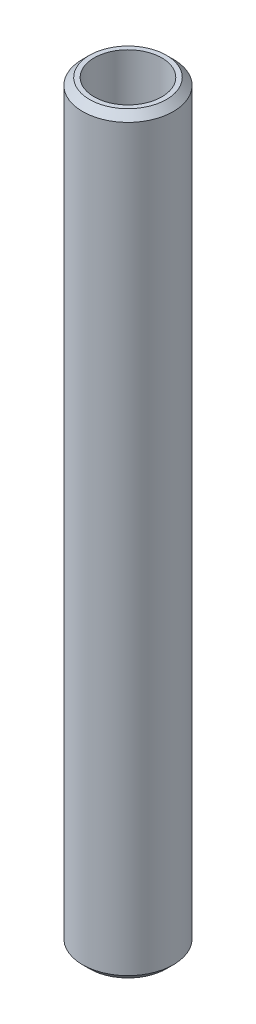
ISO-10303-21;
HEADER;
FILE_DESCRIPTION(('STEP AP214'),'2;1');
FILE_NAME('part.step','',(''),(''),'','','');
FILE_SCHEMA(('AUTOMOTIVE_DESIGN { 1 0 10303 214 1 1 1 1 }'));
ENDSEC;
DATA;
#1=APPLICATION_CONTEXT('core data for automotive mechanical design processes');
#2=APPLICATION_PROTOCOL_DEFINITION('international standard','automotive_design',2000,#1);
#3=PRODUCT_CONTEXT('',#1,'mechanical');
#4=PRODUCT('Part','Part','',(#3));
#5=PRODUCT_RELATED_PRODUCT_CATEGORY('part','',(#4));
#6=PRODUCT_DEFINITION_FORMATION('','',#4);
#7=PRODUCT_DEFINITION_CONTEXT('part definition',#1,'design');
#8=PRODUCT_DEFINITION('design','',#6,#7);
#9=PRODUCT_DEFINITION_SHAPE('','',#8);
#10=(LENGTH_UNIT() NAMED_UNIT(*) SI_UNIT(.MILLI.,.METRE.));
#11=(NAMED_UNIT(*) PLANE_ANGLE_UNIT() SI_UNIT($,.RADIAN.));
#12=(NAMED_UNIT(*) SI_UNIT($,.STERADIAN.) SOLID_ANGLE_UNIT());
#13=UNCERTAINTY_MEASURE_WITH_UNIT(LENGTH_MEASURE(1.E-05),#10,'distance_accuracy_value','');
#14=(GEOMETRIC_REPRESENTATION_CONTEXT(3) GLOBAL_UNCERTAINTY_ASSIGNED_CONTEXT((#13)) GLOBAL_UNIT_ASSIGNED_CONTEXT((#10,
#11,#12)) REPRESENTATION_CONTEXT('',''));
#15=CARTESIAN_POINT('',(0.,0.,0.));
#16=DIRECTION('',(0.,0.,1.));
#17=DIRECTION('',(1.,0.,0.));
#18=AXIS2_PLACEMENT_3D('',#15,#16,#17);
#19=CARTESIAN_POINT('',(0.,373.490931075071,0.));
#20=DIRECTION('',(0.,-1.,0.));
#21=DIRECTION('',(0.,0.,-1.));
#22=AXIS2_PLACEMENT_3D('',#19,#20,#21);
#23=CYLINDRICAL_SURFACE('',#22,22.5);
#24=CARTESIAN_POINT('',(0.,370.046088661592,0.));
#25=DIRECTION('',(0.,1.,0.));
#26=DIRECTION('',(0.,0.,1.));
#27=AXIS2_PLACEMENT_3D('',#24,#25,#26);
#28=CIRCLE('',#27,22.5);
#29=CARTESIAN_POINT('',(0.,370.046088661592,22.5));
#30=VERTEX_POINT('',#29);
#31=EDGE_CURVE('E50',#30,#30,#28,.F.);
#32=ORIENTED_EDGE('',*,*,#31,.T.);
#33=EDGE_LOOP('',(#32));
#34=FACE_BOUND('',#33,.T.);
#35=CARTESIAN_POINT('',(0.,3.44484241347864,0.));
#36=DIRECTION('',(0.,1.,0.));
#37=DIRECTION('',(0.,0.,1.));
#38=AXIS2_PLACEMENT_3D('',#35,#36,#37);
#39=CIRCLE('',#38,22.5);
#40=CARTESIAN_POINT('',(0.,3.44484241347864,22.5));
#41=VERTEX_POINT('',#40);
#42=EDGE_CURVE('E51',#41,#41,#39,.T.);
#43=ORIENTED_EDGE('',*,*,#42,.T.);
#44=EDGE_LOOP('',(#43));
#45=FACE_BOUND('',#44,.T.);
#46=ADVANCED_FACE('F39',(#34,#45),#23,.T.);
#47=CARTESIAN_POINT('',(0.,373.490931075071,0.));
#48=DIRECTION('',(0.,1.,0.));
#49=DIRECTION('',(0.,0.,1.));
#50=AXIS2_PLACEMENT_3D('',#47,#48,#49);
#51=PLANE('',#50);
#52=CARTESIAN_POINT('',(0.,373.490931075071,0.));
#53=DIRECTION('',(0.,1.,0.));
#54=DIRECTION('',(0.,0.,1.));
#55=AXIS2_PLACEMENT_3D('',#52,#53,#54);
#56=CIRCLE('',#55,19.0551575865213);
#57=CARTESIAN_POINT('',(0.,373.490931075071,19.0551575865213));
#58=VERTEX_POINT('',#57);
#59=EDGE_CURVE('E54',#58,#58,#56,.T.);
#60=ORIENTED_EDGE('',*,*,#59,.T.);
#61=EDGE_LOOP('',(#60));
#62=FACE_BOUND('',#61,.T.);
#63=CARTESIAN_POINT('',(0.,373.490931075071,0.));
#64=DIRECTION('',(0.,1.,0.));
#65=DIRECTION('',(0.,0.,1.));
#66=AXIS2_PLACEMENT_3D('',#63,#64,#65);
#67=CIRCLE('',#66,16.7843677541225);
#68=CARTESIAN_POINT('',(0.,373.490931075071,16.7843677541225));
#69=VERTEX_POINT('',#68);
#70=EDGE_CURVE('E58',#69,#69,#67,.T.);
#71=ORIENTED_EDGE('',*,*,#70,.F.);
#72=EDGE_LOOP('',(#71));
#73=FACE_BOUND('',#72,.T.);
#74=ADVANCED_FACE('F69',(#62,#73),#51,.T.);
#75=CARTESIAN_POINT('',(0.,0.,0.));
#76=DIRECTION('',(0.,1.,0.));
#77=DIRECTION('',(0.,0.,1.));
#78=AXIS2_PLACEMENT_3D('',#75,#76,#77);
#79=PLANE('',#78);
#80=CARTESIAN_POINT('',(0.,0.,0.));
#81=DIRECTION('',(0.,1.,0.));
#82=DIRECTION('',(0.,0.,1.));
#83=AXIS2_PLACEMENT_3D('',#80,#81,#82);
#84=CIRCLE('',#83,19.0551575865213);
#85=CARTESIAN_POINT('',(0.,0.,19.0551575865213));
#86=VERTEX_POINT('',#85);
#87=EDGE_CURVE('E10',#86,#86,#84,.F.);
#88=ORIENTED_EDGE('',*,*,#87,.T.);
#89=EDGE_LOOP('',(#88));
#90=FACE_BOUND('',#89,.T.);
#91=CARTESIAN_POINT('',(0.,0.,0.));
#92=DIRECTION('',(0.,1.,0.));
#93=DIRECTION('',(0.,0.,1.));
#94=AXIS2_PLACEMENT_3D('',#91,#92,#93);
#95=CIRCLE('',#94,16.7843677541225);
#96=CARTESIAN_POINT('',(0.,0.,16.7843677541225));
#97=VERTEX_POINT('',#96);
#98=EDGE_CURVE('E63',#97,#97,#95,.T.);
#99=ORIENTED_EDGE('',*,*,#98,.T.);
#100=EDGE_LOOP('',(#99));
#101=FACE_BOUND('',#100,.T.);
#102=ADVANCED_FACE('F75',(#90,#101),#79,.F.);
#103=CARTESIAN_POINT('',(0.,373.490931075071,0.));
#104=DIRECTION('',(0.,-1.,0.));
#105=DIRECTION('',(0.,0.,-1.));
#106=AXIS2_PLACEMENT_3D('',#103,#104,#105);
#107=CYLINDRICAL_SURFACE('',#106,16.7843677541225);
#108=ORIENTED_EDGE('',*,*,#70,.T.);
#109=EDGE_LOOP('',(#108));
#110=FACE_BOUND('',#109,.T.);
#111=ORIENTED_EDGE('',*,*,#98,.F.);
#112=EDGE_LOOP('',(#111));
#113=FACE_BOUND('',#112,.T.);
#114=ADVANCED_FACE('F70',(#110,#113),#107,.F.);
#115=CARTESIAN_POINT('',(0.,373.490931075071,0.));
#116=DIRECTION('',(0.,-1.,0.));
#117=DIRECTION('',(0.,0.,-1.));
#118=AXIS2_PLACEMENT_3D('',#115,#116,#117);
#119=CONICAL_SURFACE('',#118,19.0551575865213,0.785398163397446);
#120=ORIENTED_EDGE('',*,*,#31,.F.);
#121=EDGE_LOOP('',(#120));
#122=FACE_BOUND('',#121,.T.);
#123=ORIENTED_EDGE('',*,*,#59,.F.);
#124=EDGE_LOOP('',(#123));
#125=FACE_BOUND('',#124,.T.);
#126=ADVANCED_FACE('F81',(#122,#125),#119,.T.);
#127=CARTESIAN_POINT('',(0.,3.44484241347864,0.));
#128=DIRECTION('',(0.,1.,0.));
#129=DIRECTION('',(0.,0.,1.));
#130=AXIS2_PLACEMENT_3D('',#127,#128,#129);
#131=CONICAL_SURFACE('',#130,22.5,0.785398163397454);
#132=ORIENTED_EDGE('',*,*,#87,.F.);
#133=EDGE_LOOP('',(#132));
#134=FACE_BOUND('',#133,.T.);
#135=ORIENTED_EDGE('',*,*,#42,.F.);
#136=EDGE_LOOP('',(#135));
#137=FACE_BOUND('',#136,.T.);
#138=ADVANCED_FACE('F45',(#134,#137),#131,.T.);
#139=CLOSED_SHELL('',(#46,#74,#102,#114,#126,#138));
#140=MANIFOLD_SOLID_BREP('B2',#139);
#141=ADVANCED_BREP_SHAPE_REPRESENTATION('',(#18,#140),#14);
#142=SHAPE_DEFINITION_REPRESENTATION(#9,#141);
ENDSEC;
END-ISO-10303-21;
